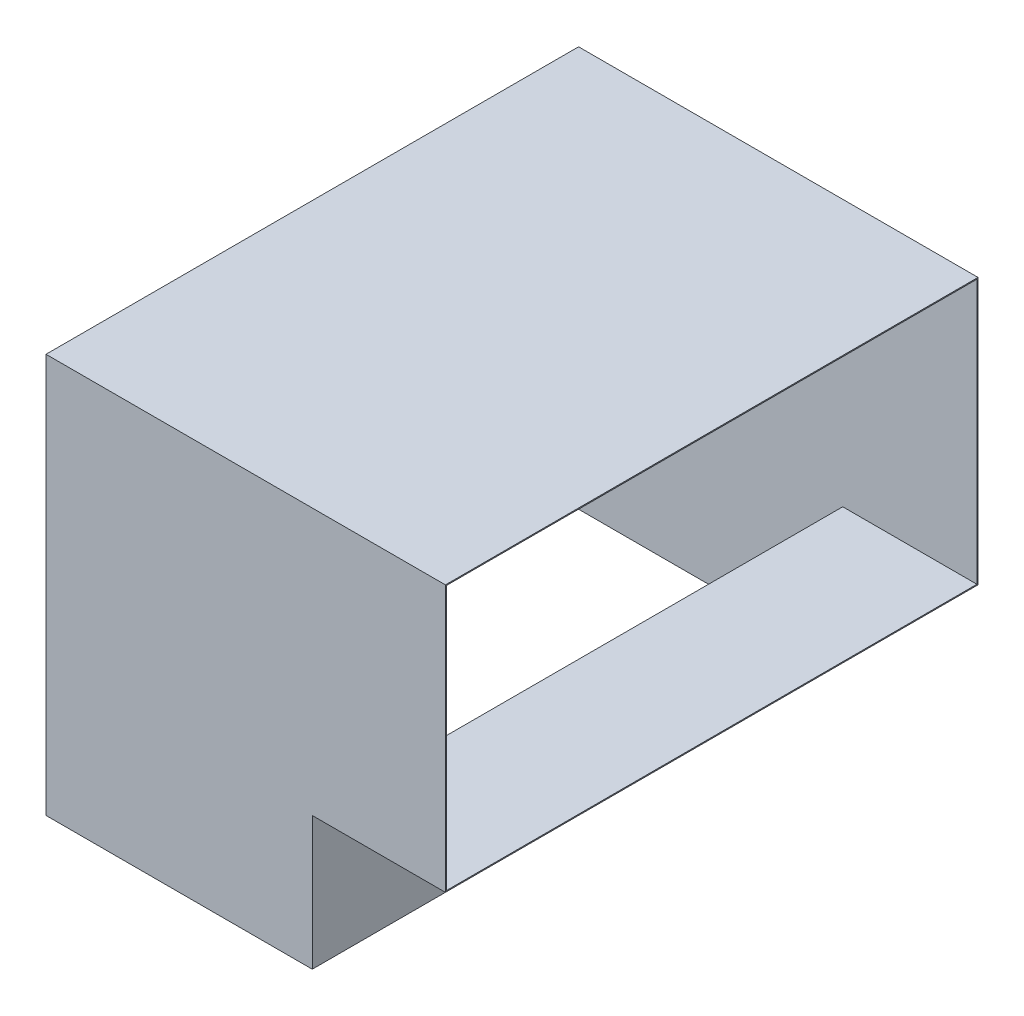
ISO-10303-21;
HEADER;
FILE_DESCRIPTION(('STEP AP214'),'2;1');
FILE_NAME('part.step','',(''),(''),'','','');
FILE_SCHEMA(('AUTOMOTIVE_DESIGN { 1 0 10303 214 1 1 1 1 }'));
ENDSEC;
DATA;
#1=APPLICATION_CONTEXT('core data for automotive mechanical design processes');
#2=APPLICATION_PROTOCOL_DEFINITION('international standard','automotive_design',2000,#1);
#3=PRODUCT_CONTEXT('',#1,'mechanical');
#4=PRODUCT('Part','Part','',(#3));
#5=PRODUCT_RELATED_PRODUCT_CATEGORY('part','',(#4));
#6=PRODUCT_DEFINITION_FORMATION('','',#4);
#7=PRODUCT_DEFINITION_CONTEXT('part definition',#1,'design');
#8=PRODUCT_DEFINITION('design','',#6,#7);
#9=PRODUCT_DEFINITION_SHAPE('','',#8);
#10=(LENGTH_UNIT() NAMED_UNIT(*) SI_UNIT(.MILLI.,.METRE.));
#11=(NAMED_UNIT(*) PLANE_ANGLE_UNIT() SI_UNIT($,.RADIAN.));
#12=(NAMED_UNIT(*) SI_UNIT($,.STERADIAN.) SOLID_ANGLE_UNIT());
#13=UNCERTAINTY_MEASURE_WITH_UNIT(LENGTH_MEASURE(1.E-05),#10,'distance_accuracy_value','');
#14=(GEOMETRIC_REPRESENTATION_CONTEXT(3) GLOBAL_UNCERTAINTY_ASSIGNED_CONTEXT((#13)) GLOBAL_UNIT_ASSIGNED_CONTEXT((#10,
#11,#12)) REPRESENTATION_CONTEXT('',''));
#15=CARTESIAN_POINT('',(0.,0.,0.));
#16=DIRECTION('',(0.,0.,1.));
#17=DIRECTION('',(1.,0.,0.));
#18=AXIS2_PLACEMENT_3D('',#15,#16,#17);
#19=CARTESIAN_POINT('',(-248.,500000.,500.));
#20=DIRECTION('',(-1.,0.,0.));
#21=DIRECTION('',(0.,0.,1.));
#22=AXIS2_PLACEMENT_3D('',#19,#20,#21);
#23=PLANE('',#22);
#24=DIRECTION('',(0.,-1.,0.));
#25=VECTOR('',#24,1.);
#26=CARTESIAN_POINT('',(-248.,500000.,-498.));
#27=LINE('',#26,#25);
#28=CARTESIAN_POINT('',(-248.,248.,-498.));
#29=VERTEX_POINT('',#28);
#30=CARTESIAN_POINT('',(-248.,-500.,-498.));
#31=VERTEX_POINT('',#30);
#32=EDGE_CURVE('E220',#29,#31,#27,.T.);
#33=ORIENTED_EDGE('',*,*,#32,.F.);
#34=DIRECTION('',(0.,0.,1.));
#35=VECTOR('',#34,1.);
#36=CARTESIAN_POINT('',(-248.,248.,500.));
#37=LINE('',#36,#35);
#38=CARTESIAN_POINT('',(-248.,248.,498.));
#39=VERTEX_POINT('',#38);
#40=EDGE_CURVE('E222',#29,#39,#37,.T.);
#41=ORIENTED_EDGE('',*,*,#40,.T.);
#42=DIRECTION('',(0.,-1.,0.));
#43=VECTOR('',#42,1.);
#44=CARTESIAN_POINT('',(-248.,500000.,498.));
#45=LINE('',#44,#43);
#46=CARTESIAN_POINT('',(-248.,-500.,498.));
#47=VERTEX_POINT('',#46);
#48=EDGE_CURVE('E224',#39,#47,#45,.T.);
#49=ORIENTED_EDGE('',*,*,#48,.T.);
#50=DIRECTION('',(0.,0.,-1.));
#51=VECTOR('',#50,1.);
#52=CARTESIAN_POINT('',(-248.,-500.,500.));
#53=LINE('',#52,#51);
#54=EDGE_CURVE('E214',#47,#31,#53,.T.);
#55=ORIENTED_EDGE('',*,*,#54,.T.);
#56=EDGE_LOOP('',(#33,#41,#49,#55));
#57=FACE_BOUND('',#56,.T.);
#58=ADVANCED_FACE('F107',(#57),#23,.F.);
#59=CARTESIAN_POINT('',(248.,500000.,500.));
#60=DIRECTION('',(1.,0.,0.));
#61=DIRECTION('',(0.,0.,-1.));
#62=AXIS2_PLACEMENT_3D('',#59,#60,#61);
#63=PLANE('',#62);
#64=DIRECTION('',(0.,-1.,0.));
#65=VECTOR('',#64,1.);
#66=CARTESIAN_POINT('',(248.,500000.,498.));
#67=LINE('',#66,#65);
#68=CARTESIAN_POINT('',(248.,-248.,498.));
#69=VERTEX_POINT('',#68);
#70=CARTESIAN_POINT('',(248.,-500.,498.));
#71=VERTEX_POINT('',#70);
#72=EDGE_CURVE('E213',#69,#71,#67,.T.);
#73=ORIENTED_EDGE('',*,*,#72,.F.);
#74=DIRECTION('',(0.,0.,1.));
#75=VECTOR('',#74,1.);
#76=CARTESIAN_POINT('',(248.,-248.,498.));
#77=LINE('',#76,#75);
#78=CARTESIAN_POINT('',(248.,-248.,-498.));
#79=VERTEX_POINT('',#78);
#80=EDGE_CURVE('E197',#79,#69,#77,.T.);
#81=ORIENTED_EDGE('',*,*,#80,.F.);
#82=DIRECTION('',(0.,-1.,0.));
#83=VECTOR('',#82,1.);
#84=CARTESIAN_POINT('',(248.,500000.,-498.));
#85=LINE('',#84,#83);
#86=CARTESIAN_POINT('',(248.,-500.,-498.));
#87=VERTEX_POINT('',#86);
#88=EDGE_CURVE('E211',#79,#87,#85,.T.);
#89=ORIENTED_EDGE('',*,*,#88,.T.);
#90=DIRECTION('',(0.,0.,1.));
#91=VECTOR('',#90,1.);
#92=CARTESIAN_POINT('',(248.,-500.,500.));
#93=LINE('',#92,#91);
#94=EDGE_CURVE('E295',#87,#71,#93,.T.);
#95=ORIENTED_EDGE('',*,*,#94,.T.);
#96=EDGE_LOOP('',(#73,#81,#89,#95));
#97=FACE_BOUND('',#96,.T.);
#98=ADVANCED_FACE('F209',(#97),#63,.F.);
#99=CARTESIAN_POINT('',(-250.,250.,498.));
#100=DIRECTION('',(0.,0.,1.));
#101=DIRECTION('',(0.,-1.,0.));
#102=AXIS2_PLACEMENT_3D('',#99,#100,#101);
#103=PLANE('',#102);
#104=DIRECTION('',(1.,0.,0.));
#105=VECTOR('',#104,1.);
#106=CARTESIAN_POINT('',(-250.,-248.,498.));
#107=LINE('',#106,#105);
#108=CARTESIAN_POINT('',(500.,-248.,498.));
#109=VERTEX_POINT('',#108);
#110=EDGE_CURVE('E206',#69,#109,#107,.T.);
#111=ORIENTED_EDGE('',*,*,#110,.F.);
#112=ORIENTED_EDGE('',*,*,#72,.T.);
#113=DIRECTION('',(-1.,0.,0.));
#114=VECTOR('',#113,1.);
#115=CARTESIAN_POINT('',(-250.,-500.,498.));
#116=LINE('',#115,#114);
#117=EDGE_CURVE('E290',#71,#47,#116,.T.);
#118=ORIENTED_EDGE('',*,*,#117,.T.);
#119=ORIENTED_EDGE('',*,*,#48,.F.);
#120=DIRECTION('',(1.,0.,0.));
#121=VECTOR('',#120,1.);
#122=CARTESIAN_POINT('',(-250.,248.,498.));
#123=LINE('',#122,#121);
#124=CARTESIAN_POINT('',(500.,248.,498.));
#125=VERTEX_POINT('',#124);
#126=EDGE_CURVE('E252',#39,#125,#123,.T.);
#127=ORIENTED_EDGE('',*,*,#126,.T.);
#128=DIRECTION('',(0.,-1.,0.));
#129=VECTOR('',#128,1.);
#130=CARTESIAN_POINT('',(500.,250.,498.));
#131=LINE('',#130,#129);
#132=EDGE_CURVE('E231',#125,#109,#131,.T.);
#133=ORIENTED_EDGE('',*,*,#132,.T.);
#134=EDGE_LOOP('',(#111,#112,#118,#119,#127,#133));
#135=FACE_BOUND('',#134,.T.);
#136=ADVANCED_FACE('F312',(#135),#103,.F.);
#137=CARTESIAN_POINT('',(-250.,248.,500.));
#138=DIRECTION('',(0.,1.,0.));
#139=DIRECTION('',(0.,0.,1.));
#140=AXIS2_PLACEMENT_3D('',#137,#138,#139);
#141=PLANE('',#140);
#142=DIRECTION('',(0.,0.,1.));
#143=VECTOR('',#142,1.);
#144=CARTESIAN_POINT('',(500.,248.,500.));
#145=LINE('',#144,#143);
#146=CARTESIAN_POINT('',(500.,248.,-498.));
#147=VERTEX_POINT('',#146);
#148=EDGE_CURVE('E237',#147,#125,#145,.T.);
#149=ORIENTED_EDGE('',*,*,#148,.T.);
#150=ORIENTED_EDGE('',*,*,#126,.F.);
#151=ORIENTED_EDGE('',*,*,#40,.F.);
#152=DIRECTION('',(1.,0.,0.));
#153=VECTOR('',#152,1.);
#154=CARTESIAN_POINT('',(-250.,248.,-498.));
#155=LINE('',#154,#153);
#156=EDGE_CURVE('E205',#29,#147,#155,.T.);
#157=ORIENTED_EDGE('',*,*,#156,.T.);
#158=EDGE_LOOP('',(#149,#150,#151,#157));
#159=FACE_BOUND('',#158,.T.);
#160=ADVANCED_FACE('F334',(#159),#141,.F.);
#161=CARTESIAN_POINT('',(-250.,250.,-498.));
#162=DIRECTION('',(0.,0.,-1.));
#163=DIRECTION('',(0.,1.,0.));
#164=AXIS2_PLACEMENT_3D('',#161,#162,#163);
#165=PLANE('',#164);
#166=DIRECTION('',(0.,1.,0.));
#167=VECTOR('',#166,1.);
#168=CARTESIAN_POINT('',(500.,250.,-498.));
#169=LINE('',#168,#167);
#170=CARTESIAN_POINT('',(500.,-248.,-498.));
#171=VERTEX_POINT('',#170);
#172=EDGE_CURVE('E235',#171,#147,#169,.T.);
#173=ORIENTED_EDGE('',*,*,#172,.T.);
#174=ORIENTED_EDGE('',*,*,#156,.F.);
#175=ORIENTED_EDGE('',*,*,#32,.T.);
#176=DIRECTION('',(1.,0.,0.));
#177=VECTOR('',#176,1.);
#178=CARTESIAN_POINT('',(-250.,-500.,-498.));
#179=LINE('',#178,#177);
#180=EDGE_CURVE('E218',#31,#87,#179,.T.);
#181=ORIENTED_EDGE('',*,*,#180,.T.);
#182=ORIENTED_EDGE('',*,*,#88,.F.);
#183=DIRECTION('',(1.,0.,0.));
#184=VECTOR('',#183,1.);
#185=CARTESIAN_POINT('',(-250.,-248.,-498.));
#186=LINE('',#185,#184);
#187=EDGE_CURVE('E194',#79,#171,#186,.T.);
#188=ORIENTED_EDGE('',*,*,#187,.T.);
#189=EDGE_LOOP('',(#173,#174,#175,#181,#182,#188));
#190=FACE_BOUND('',#189,.T.);
#191=ADVANCED_FACE('F216',(#190),#165,.F.);
#192=CARTESIAN_POINT('',(-250.,-248.,500.));
#193=DIRECTION('',(0.,-1.,0.));
#194=DIRECTION('',(0.,0.,-1.));
#195=AXIS2_PLACEMENT_3D('',#192,#193,#194);
#196=PLANE('',#195);
#197=ORIENTED_EDGE('',*,*,#187,.F.);
#198=ORIENTED_EDGE('',*,*,#80,.T.);
#199=ORIENTED_EDGE('',*,*,#110,.T.);
#200=DIRECTION('',(0.,0.,-1.));
#201=VECTOR('',#200,1.);
#202=CARTESIAN_POINT('',(500.,-248.,500.));
#203=LINE('',#202,#201);
#204=EDGE_CURVE('E200',#109,#171,#203,.T.);
#205=ORIENTED_EDGE('',*,*,#204,.T.);
#206=EDGE_LOOP('',(#197,#198,#199,#205));
#207=FACE_BOUND('',#206,.T.);
#208=ADVANCED_FACE('F196',(#207),#196,.F.);
#209=CARTESIAN_POINT('',(-250.,250.,500.));
#210=DIRECTION('',(0.,0.,1.));
#211=DIRECTION('',(0.,-1.,0.));
#212=AXIS2_PLACEMENT_3D('',#209,#210,#211);
#213=PLANE('',#212);
#214=DIRECTION('',(0.,-1.,0.));
#215=VECTOR('',#214,1.);
#216=CARTESIAN_POINT('',(500.,250.,500.));
#217=LINE('',#216,#215);
#218=CARTESIAN_POINT('',(500.,250.,500.));
#219=VERTEX_POINT('',#218);
#220=CARTESIAN_POINT('',(500.,-250.,500.));
#221=VERTEX_POINT('',#220);
#222=EDGE_CURVE('E240',#219,#221,#217,.T.);
#223=ORIENTED_EDGE('',*,*,#222,.F.);
#224=DIRECTION('',(1.,0.,0.));
#225=VECTOR('',#224,1.);
#226=CARTESIAN_POINT('',(-250.,250.,500.));
#227=LINE('',#226,#225);
#228=CARTESIAN_POINT('',(-250.,250.,500.));
#229=VERTEX_POINT('',#228);
#230=EDGE_CURVE('E12',#229,#219,#227,.T.);
#231=ORIENTED_EDGE('',*,*,#230,.F.);
#232=DIRECTION('',(0.,-1.,0.));
#233=VECTOR('',#232,1.);
#234=CARTESIAN_POINT('',(-250.,250.,500.));
#235=LINE('',#234,#233);
#236=CARTESIAN_POINT('',(-250.,-500.,500.));
#237=VERTEX_POINT('',#236);
#238=EDGE_CURVE('E254',#229,#237,#235,.T.);
#239=ORIENTED_EDGE('',*,*,#238,.T.);
#240=DIRECTION('',(-1.,0.,0.));
#241=VECTOR('',#240,1.);
#242=CARTESIAN_POINT('',(-250.,-500.,500.));
#243=LINE('',#242,#241);
#244=CARTESIAN_POINT('',(250.,-500.,500.));
#245=VERTEX_POINT('',#244);
#246=EDGE_CURVE('E301',#245,#237,#243,.T.);
#247=ORIENTED_EDGE('',*,*,#246,.F.);
#248=DIRECTION('',(0.,-1.,0.));
#249=VECTOR('',#248,1.);
#250=CARTESIAN_POINT('',(250.,500000.,500.));
#251=LINE('',#250,#249);
#252=CARTESIAN_POINT('',(250.,-250.,500.));
#253=VERTEX_POINT('',#252);
#254=EDGE_CURVE('E269',#253,#245,#251,.T.);
#255=ORIENTED_EDGE('',*,*,#254,.F.);
#256=DIRECTION('',(1.,0.,0.));
#257=VECTOR('',#256,1.);
#258=CARTESIAN_POINT('',(-250.,-250.,500.));
#259=LINE('',#258,#257);
#260=EDGE_CURVE('E111',#253,#221,#259,.T.);
#261=ORIENTED_EDGE('',*,*,#260,.T.);
#262=EDGE_LOOP('',(#223,#231,#239,#247,#255,#261));
#263=FACE_BOUND('',#262,.T.);
#264=ADVANCED_FACE('F109',(#263),#213,.T.);
#265=CARTESIAN_POINT('',(-250.,250.,500.));
#266=DIRECTION('',(0.,1.,0.));
#267=DIRECTION('',(0.,0.,1.));
#268=AXIS2_PLACEMENT_3D('',#265,#266,#267);
#269=PLANE('',#268);
#270=DIRECTION('',(0.,0.,1.));
#271=VECTOR('',#270,1.);
#272=CARTESIAN_POINT('',(500.,250.,500.));
#273=LINE('',#272,#271);
#274=CARTESIAN_POINT('',(500.,250.,-500.));
#275=VERTEX_POINT('',#274);
#276=EDGE_CURVE('E249',#275,#219,#273,.T.);
#277=ORIENTED_EDGE('',*,*,#276,.F.);
#278=DIRECTION('',(1.,0.,0.));
#279=VECTOR('',#278,1.);
#280=CARTESIAN_POINT('',(-250.,250.,-500.));
#281=LINE('',#280,#279);
#282=CARTESIAN_POINT('',(-250.,250.,-500.));
#283=VERTEX_POINT('',#282);
#284=EDGE_CURVE('E116',#283,#275,#281,.T.);
#285=ORIENTED_EDGE('',*,*,#284,.F.);
#286=DIRECTION('',(0.,0.,1.));
#287=VECTOR('',#286,1.);
#288=CARTESIAN_POINT('',(-250.,250.,500.));
#289=LINE('',#288,#287);
#290=EDGE_CURVE('E261',#283,#229,#289,.T.);
#291=ORIENTED_EDGE('',*,*,#290,.T.);
#292=ORIENTED_EDGE('',*,*,#230,.T.);
#293=EDGE_LOOP('',(#277,#285,#291,#292));
#294=FACE_BOUND('',#293,.T.);
#295=ADVANCED_FACE('F277',(#294),#269,.T.);
#296=CARTESIAN_POINT('',(-250.,250.,-500.));
#297=DIRECTION('',(0.,0.,-1.));
#298=DIRECTION('',(0.,1.,0.));
#299=AXIS2_PLACEMENT_3D('',#296,#297,#298);
#300=PLANE('',#299);
#301=DIRECTION('',(1.,0.,0.));
#302=VECTOR('',#301,1.);
#303=CARTESIAN_POINT('',(-250.,-250.,-500.));
#304=LINE('',#303,#302);
#305=CARTESIAN_POINT('',(250.,-250.,-500.));
#306=VERTEX_POINT('',#305);
#307=CARTESIAN_POINT('',(500.,-250.,-500.));
#308=VERTEX_POINT('',#307);
#309=EDGE_CURVE('E264',#306,#308,#304,.T.);
#310=ORIENTED_EDGE('',*,*,#309,.F.);
#311=DIRECTION('',(0.,-1.,0.));
#312=VECTOR('',#311,1.);
#313=CARTESIAN_POINT('',(250.,500000.,-500.));
#314=LINE('',#313,#312);
#315=CARTESIAN_POINT('',(250.,-500.,-500.));
#316=VERTEX_POINT('',#315);
#317=EDGE_CURVE('E303',#306,#316,#314,.T.);
#318=ORIENTED_EDGE('',*,*,#317,.T.);
#319=DIRECTION('',(1.,0.,0.));
#320=VECTOR('',#319,1.);
#321=CARTESIAN_POINT('',(-250.,-500.,-500.));
#322=LINE('',#321,#320);
#323=CARTESIAN_POINT('',(-250.,-500.,-500.));
#324=VERTEX_POINT('',#323);
#325=EDGE_CURVE('E289',#324,#316,#322,.T.);
#326=ORIENTED_EDGE('',*,*,#325,.F.);
#327=DIRECTION('',(0.,1.,0.));
#328=VECTOR('',#327,1.);
#329=CARTESIAN_POINT('',(-250.,250.,-500.));
#330=LINE('',#329,#328);
#331=EDGE_CURVE('E258',#324,#283,#330,.T.);
#332=ORIENTED_EDGE('',*,*,#331,.T.);
#333=ORIENTED_EDGE('',*,*,#284,.T.);
#334=DIRECTION('',(0.,1.,0.));
#335=VECTOR('',#334,1.);
#336=CARTESIAN_POINT('',(500.,250.,-500.));
#337=LINE('',#336,#335);
#338=EDGE_CURVE('E246',#308,#275,#337,.T.);
#339=ORIENTED_EDGE('',*,*,#338,.F.);
#340=EDGE_LOOP('',(#310,#318,#326,#332,#333,#339));
#341=FACE_BOUND('',#340,.T.);
#342=ADVANCED_FACE('F348',(#341),#300,.T.);
#343=CARTESIAN_POINT('',(-250.,-250.,500.));
#344=DIRECTION('',(0.,-1.,0.));
#345=DIRECTION('',(0.,0.,-1.));
#346=AXIS2_PLACEMENT_3D('',#343,#344,#345);
#347=PLANE('',#346);
#348=DIRECTION('',(0.,0.,1.));
#349=VECTOR('',#348,1.);
#350=CARTESIAN_POINT('',(250.,-250.,500.));
#351=LINE('',#350,#349);
#352=EDGE_CURVE('E127',#306,#253,#351,.T.);
#353=ORIENTED_EDGE('',*,*,#352,.F.);
#354=ORIENTED_EDGE('',*,*,#309,.T.);
#355=DIRECTION('',(0.,0.,-1.));
#356=VECTOR('',#355,1.);
#357=CARTESIAN_POINT('',(500.,-250.,500.));
#358=LINE('',#357,#356);
#359=EDGE_CURVE('E243',#221,#308,#358,.T.);
#360=ORIENTED_EDGE('',*,*,#359,.F.);
#361=ORIENTED_EDGE('',*,*,#260,.F.);
#362=EDGE_LOOP('',(#353,#354,#360,#361));
#363=FACE_BOUND('',#362,.T.);
#364=ADVANCED_FACE('F270',(#363),#347,.T.);
#365=CARTESIAN_POINT('',(-250.,0.,0.));
#366=DIRECTION('',(1.,0.,0.));
#367=DIRECTION('',(0.,0.,-1.));
#368=AXIS2_PLACEMENT_3D('',#365,#366,#367);
#369=PLANE('',#368);
#370=ORIENTED_EDGE('',*,*,#238,.F.);
#371=ORIENTED_EDGE('',*,*,#290,.F.);
#372=ORIENTED_EDGE('',*,*,#331,.F.);
#373=DIRECTION('',(0.,0.,-1.));
#374=VECTOR('',#373,1.);
#375=CARTESIAN_POINT('',(-250.,-500.,500.));
#376=LINE('',#375,#374);
#377=EDGE_CURVE('E285',#237,#324,#376,.T.);
#378=ORIENTED_EDGE('',*,*,#377,.F.);
#379=EDGE_LOOP('',(#370,#371,#372,#378));
#380=FACE_BOUND('',#379,.T.);
#381=ADVANCED_FACE('F283',(#380),#369,.F.);
#382=CARTESIAN_POINT('',(500.,0.,0.));
#383=DIRECTION('',(1.,0.,0.));
#384=DIRECTION('',(0.,0.,-1.));
#385=AXIS2_PLACEMENT_3D('',#382,#383,#384);
#386=PLANE('',#385);
#387=ORIENTED_EDGE('',*,*,#222,.T.);
#388=ORIENTED_EDGE('',*,*,#359,.T.);
#389=ORIENTED_EDGE('',*,*,#338,.T.);
#390=ORIENTED_EDGE('',*,*,#276,.T.);
#391=EDGE_LOOP('',(#387,#388,#389,#390));
#392=FACE_BOUND('',#391,.T.);
#393=ORIENTED_EDGE('',*,*,#204,.F.);
#394=ORIENTED_EDGE('',*,*,#132,.F.);
#395=ORIENTED_EDGE('',*,*,#148,.F.);
#396=ORIENTED_EDGE('',*,*,#172,.F.);
#397=EDGE_LOOP('',(#393,#394,#395,#396));
#398=FACE_BOUND('',#397,.T.);
#399=ADVANCED_FACE('F273',(#392,#398),#386,.T.);
#400=CARTESIAN_POINT('',(250.,500000.,500.));
#401=DIRECTION('',(1.,0.,0.));
#402=DIRECTION('',(0.,0.,-1.));
#403=AXIS2_PLACEMENT_3D('',#400,#401,#402);
#404=PLANE('',#403);
#405=ORIENTED_EDGE('',*,*,#317,.F.);
#406=ORIENTED_EDGE('',*,*,#352,.T.);
#407=ORIENTED_EDGE('',*,*,#254,.T.);
#408=DIRECTION('',(0.,0.,1.));
#409=VECTOR('',#408,1.);
#410=CARTESIAN_POINT('',(250.,-500.,500.));
#411=LINE('',#410,#409);
#412=EDGE_CURVE('E292',#316,#245,#411,.T.);
#413=ORIENTED_EDGE('',*,*,#412,.F.);
#414=EDGE_LOOP('',(#405,#406,#407,#413));
#415=FACE_BOUND('',#414,.T.);
#416=ADVANCED_FACE('F318',(#415),#404,.T.);
#417=CARTESIAN_POINT('',(0.,-500.,0.));
#418=DIRECTION('',(0.,-1.,0.));
#419=DIRECTION('',(0.,0.,-1.));
#420=AXIS2_PLACEMENT_3D('',#417,#418,#419);
#421=PLANE('',#420);
#422=ORIENTED_EDGE('',*,*,#377,.T.);
#423=ORIENTED_EDGE('',*,*,#325,.T.);
#424=ORIENTED_EDGE('',*,*,#412,.T.);
#425=ORIENTED_EDGE('',*,*,#246,.T.);
#426=EDGE_LOOP('',(#422,#423,#424,#425));
#427=FACE_BOUND('',#426,.T.);
#428=ORIENTED_EDGE('',*,*,#180,.F.);
#429=ORIENTED_EDGE('',*,*,#54,.F.);
#430=ORIENTED_EDGE('',*,*,#117,.F.);
#431=ORIENTED_EDGE('',*,*,#94,.F.);
#432=EDGE_LOOP('',(#428,#429,#430,#431));
#433=FACE_BOUND('',#432,.T.);
#434=ADVANCED_FACE('F314',(#427,#433),#421,.T.);
#435=CLOSED_SHELL('',(#58,#98,#136,#160,#191,#208,#264,#295,#342,#364,#381,#399,#416,#434));
#436=MANIFOLD_SOLID_BREP('B2',#435);
#437=ADVANCED_BREP_SHAPE_REPRESENTATION('',(#18,#436),#14);
#438=SHAPE_DEFINITION_REPRESENTATION(#9,#437);
ENDSEC;
END-ISO-10303-21;
